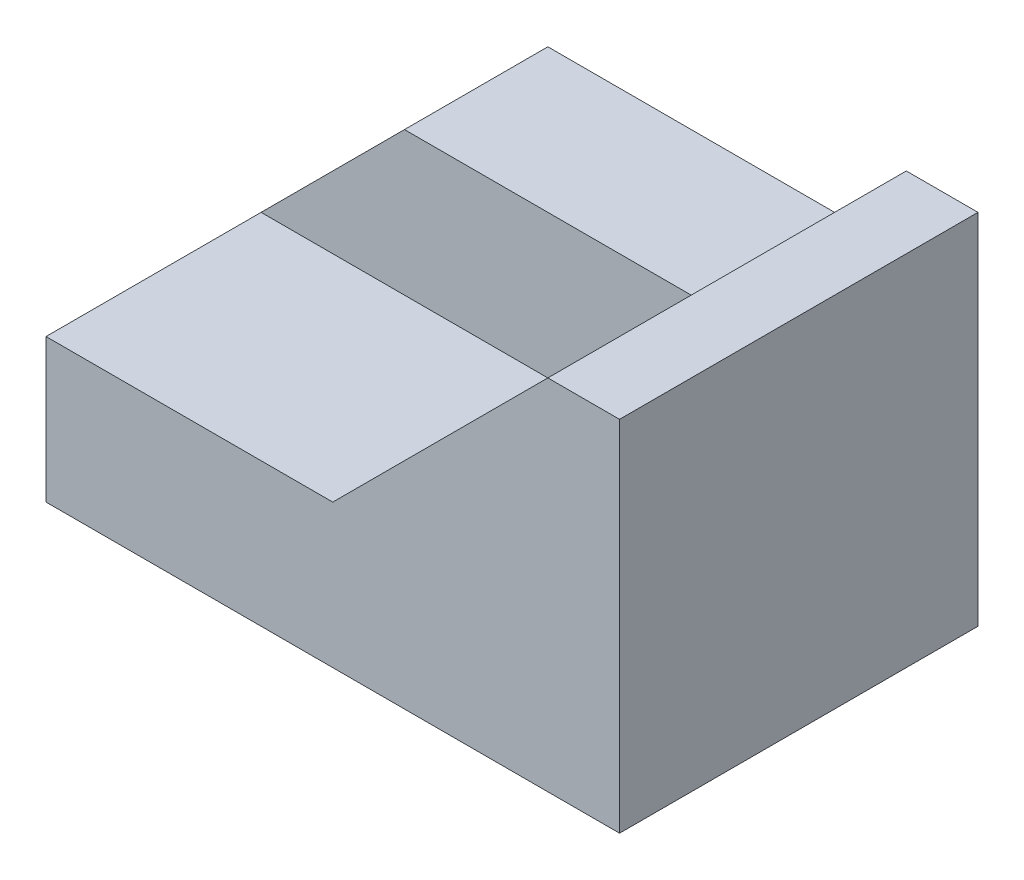
ISO-10303-21;
HEADER;
FILE_DESCRIPTION(('STEP AP214'),'2;1');
FILE_NAME('part.step','',(''),(''),'','','');
FILE_SCHEMA(('AUTOMOTIVE_DESIGN { 1 0 10303 214 1 1 1 1 }'));
ENDSEC;
DATA;
#1=APPLICATION_CONTEXT('core data for automotive mechanical design processes');
#2=APPLICATION_PROTOCOL_DEFINITION('international standard','automotive_design',2000,#1);
#3=PRODUCT_CONTEXT('',#1,'mechanical');
#4=PRODUCT('Part','Part','',(#3));
#5=PRODUCT_RELATED_PRODUCT_CATEGORY('part','',(#4));
#6=PRODUCT_DEFINITION_FORMATION('','',#4);
#7=PRODUCT_DEFINITION_CONTEXT('part definition',#1,'design');
#8=PRODUCT_DEFINITION('design','',#6,#7);
#9=PRODUCT_DEFINITION_SHAPE('','',#8);
#10=(LENGTH_UNIT() NAMED_UNIT(*) SI_UNIT(.MILLI.,.METRE.));
#11=(NAMED_UNIT(*) PLANE_ANGLE_UNIT() SI_UNIT($,.RADIAN.));
#12=(NAMED_UNIT(*) SI_UNIT($,.STERADIAN.) SOLID_ANGLE_UNIT());
#13=UNCERTAINTY_MEASURE_WITH_UNIT(LENGTH_MEASURE(1.E-05),#10,'distance_accuracy_value','');
#14=(GEOMETRIC_REPRESENTATION_CONTEXT(3) GLOBAL_UNCERTAINTY_ASSIGNED_CONTEXT((#13)) GLOBAL_UNIT_ASSIGNED_CONTEXT((#10,
#11,#12)) REPRESENTATION_CONTEXT('',''));
#15=CARTESIAN_POINT('',(0.,0.,0.));
#16=DIRECTION('',(0.,0.,1.));
#17=DIRECTION('',(1.,0.,0.));
#18=AXIS2_PLACEMENT_3D('',#15,#16,#17);
#19=CARTESIAN_POINT('',(60.,40.,0.));
#20=DIRECTION('',(0.,-1.,0.));
#21=DIRECTION('',(0.,0.,-1.));
#22=AXIS2_PLACEMENT_3D('',#19,#20,#21);
#23=PLANE('',#22);
#24=DIRECTION('',(-1.,0.,0.));
#25=VECTOR('',#24,1.);
#26=CARTESIAN_POINT('',(60.,40.,20.));
#27=LINE('',#26,#25);
#28=CARTESIAN_POINT('',(60.,40.,20.));
#29=VERTEX_POINT('',#28);
#30=CARTESIAN_POINT('',(20.,40.,20.));
#31=VERTEX_POINT('',#30);
#32=EDGE_CURVE('E48',#29,#31,#27,.T.);
#33=ORIENTED_EDGE('',*,*,#32,.F.);
#34=DIRECTION('',(0.,0.,1.));
#35=VECTOR('',#34,1.);
#36=CARTESIAN_POINT('',(60.,40.,0.));
#37=LINE('',#36,#35);
#38=CARTESIAN_POINT('',(60.,40.,0.));
#39=VERTEX_POINT('',#38);
#40=EDGE_CURVE('E133',#39,#29,#37,.T.);
#41=ORIENTED_EDGE('',*,*,#40,.F.);
#42=DIRECTION('',(1.,0.,0.));
#43=VECTOR('',#42,1.);
#44=CARTESIAN_POINT('',(60.,40.,0.));
#45=LINE('',#44,#43);
#46=CARTESIAN_POINT('',(20.,40.,0.));
#47=VERTEX_POINT('',#46);
#48=EDGE_CURVE('E56',#47,#39,#45,.T.);
#49=ORIENTED_EDGE('',*,*,#48,.F.);
#50=DIRECTION('',(0.,0.,1.));
#51=VECTOR('',#50,1.);
#52=CARTESIAN_POINT('',(20.,40.,0.));
#53=LINE('',#52,#51);
#54=EDGE_CURVE('E130',#47,#31,#53,.T.);
#55=ORIENTED_EDGE('',*,*,#54,.T.);
#56=EDGE_LOOP('',(#33,#41,#49,#55));
#57=FACE_BOUND('',#56,.T.);
#58=ADVANCED_FACE('F33',(#57),#23,.F.);
#59=CARTESIAN_POINT('',(20.,40.,0.));
#60=DIRECTION('',(0.707106781186548,-0.707106781186548,0.));
#61=DIRECTION('',(0.707106781186548,0.707106781186548,0.));
#62=AXIS2_PLACEMENT_3D('',#59,#60,#61);
#63=PLANE('',#62);
#64=DIRECTION('',(-0.707106781186548,-0.707106781186548,0.));
#65=VECTOR('',#64,1.);
#66=CARTESIAN_POINT('',(20.,40.,20.));
#67=LINE('',#66,#65);
#68=CARTESIAN_POINT('',(0.,20.,20.));
#69=VERTEX_POINT('',#68);
#70=EDGE_CURVE('E112',#31,#69,#67,.T.);
#71=ORIENTED_EDGE('',*,*,#70,.F.);
#72=ORIENTED_EDGE('',*,*,#54,.F.);
#73=DIRECTION('',(0.707106781186548,0.707106781186548,0.));
#74=VECTOR('',#73,1.);
#75=CARTESIAN_POINT('',(20.,40.,0.));
#76=LINE('',#75,#74);
#77=CARTESIAN_POINT('',(0.,20.,0.));
#78=VERTEX_POINT('',#77);
#79=EDGE_CURVE('E129',#78,#47,#76,.T.);
#80=ORIENTED_EDGE('',*,*,#79,.F.);
#81=DIRECTION('',(0.,0.,1.));
#82=VECTOR('',#81,1.);
#83=CARTESIAN_POINT('',(0.,20.,0.));
#84=LINE('',#83,#82);
#85=EDGE_CURVE('E122',#78,#69,#84,.T.);
#86=ORIENTED_EDGE('',*,*,#85,.T.);
#87=EDGE_LOOP('',(#71,#72,#80,#86));
#88=FACE_BOUND('',#87,.T.);
#89=ADVANCED_FACE('F127',(#88),#63,.F.);
#90=CARTESIAN_POINT('',(0.,0.,50.));
#91=DIRECTION('',(1.,0.,0.));
#92=DIRECTION('',(0.,0.,-1.));
#93=AXIS2_PLACEMENT_3D('',#90,#91,#92);
#94=PLANE('',#93);
#95=DIRECTION('',(0.,-1.,0.));
#96=VECTOR('',#95,1.);
#97=CARTESIAN_POINT('',(0.,0.,50.));
#98=LINE('',#97,#96);
#99=CARTESIAN_POINT('',(0.,20.,50.));
#100=VERTEX_POINT('',#99);
#101=CARTESIAN_POINT('',(0.,0.,50.));
#102=VERTEX_POINT('',#101);
#103=EDGE_CURVE('E125',#100,#102,#98,.T.);
#104=ORIENTED_EDGE('',*,*,#103,.F.);
#105=DIRECTION('',(0.,0.,1.));
#106=VECTOR('',#105,1.);
#107=CARTESIAN_POINT('',(0.,20.,20.));
#108=LINE('',#107,#106);
#109=EDGE_CURVE('E106',#69,#100,#108,.T.);
#110=ORIENTED_EDGE('',*,*,#109,.F.);
#111=ORIENTED_EDGE('',*,*,#85,.F.);
#112=DIRECTION('',(0.,-1.,0.));
#113=VECTOR('',#112,1.);
#114=CARTESIAN_POINT('',(0.,0.,0.));
#115=LINE('',#114,#113);
#116=CARTESIAN_POINT('',(0.,0.,0.));
#117=VERTEX_POINT('',#116);
#118=EDGE_CURVE('E149',#78,#117,#115,.T.);
#119=ORIENTED_EDGE('',*,*,#118,.T.);
#120=DIRECTION('',(0.,0.,-1.));
#121=VECTOR('',#120,1.);
#122=CARTESIAN_POINT('',(0.,0.,50.));
#123=LINE('',#122,#121);
#124=EDGE_CURVE('E11',#102,#117,#123,.T.);
#125=ORIENTED_EDGE('',*,*,#124,.F.);
#126=EDGE_LOOP('',(#104,#110,#111,#119,#125));
#127=FACE_BOUND('',#126,.T.);
#128=ADVANCED_FACE('F35',(#127),#94,.F.);
#129=CARTESIAN_POINT('',(0.,0.,50.));
#130=DIRECTION('',(0.,1.,0.));
#131=DIRECTION('',(0.,0.,1.));
#132=AXIS2_PLACEMENT_3D('',#129,#130,#131);
#133=PLANE('',#132);
#134=DIRECTION('',(1.,0.,0.));
#135=VECTOR('',#134,1.);
#136=CARTESIAN_POINT('',(0.,0.,0.));
#137=LINE('',#136,#135);
#138=CARTESIAN_POINT('',(80.,0.,0.));
#139=VERTEX_POINT('',#138);
#140=EDGE_CURVE('E151',#117,#139,#137,.T.);
#141=ORIENTED_EDGE('',*,*,#140,.T.);
#142=DIRECTION('',(0.,0.,-1.));
#143=VECTOR('',#142,1.);
#144=CARTESIAN_POINT('',(80.,0.,50.));
#145=LINE('',#144,#143);
#146=CARTESIAN_POINT('',(80.,0.,50.));
#147=VERTEX_POINT('',#146);
#148=EDGE_CURVE('E41',#147,#139,#145,.T.);
#149=ORIENTED_EDGE('',*,*,#148,.F.);
#150=DIRECTION('',(1.,0.,0.));
#151=VECTOR('',#150,1.);
#152=CARTESIAN_POINT('',(0.,0.,50.));
#153=LINE('',#152,#151);
#154=EDGE_CURVE('E140',#102,#147,#153,.T.);
#155=ORIENTED_EDGE('',*,*,#154,.F.);
#156=ORIENTED_EDGE('',*,*,#124,.T.);
#157=EDGE_LOOP('',(#141,#149,#155,#156));
#158=FACE_BOUND('',#157,.T.);
#159=ADVANCED_FACE('F180',(#158),#133,.F.);
#160=CARTESIAN_POINT('',(80.,0.,50.));
#161=DIRECTION('',(-1.,0.,0.));
#162=DIRECTION('',(0.,0.,1.));
#163=AXIS2_PLACEMENT_3D('',#160,#161,#162);
#164=PLANE('',#163);
#165=DIRECTION('',(0.,1.,0.));
#166=VECTOR('',#165,1.);
#167=CARTESIAN_POINT('',(80.,0.,0.));
#168=LINE('',#167,#166);
#169=CARTESIAN_POINT('',(80.,50.,0.));
#170=VERTEX_POINT('',#169);
#171=EDGE_CURVE('E154',#139,#170,#168,.T.);
#172=ORIENTED_EDGE('',*,*,#171,.T.);
#173=DIRECTION('',(0.,0.,-1.));
#174=VECTOR('',#173,1.);
#175=CARTESIAN_POINT('',(80.,50.,50.));
#176=LINE('',#175,#174);
#177=CARTESIAN_POINT('',(80.,50.,50.));
#178=VERTEX_POINT('',#177);
#179=EDGE_CURVE('E148',#178,#170,#176,.T.);
#180=ORIENTED_EDGE('',*,*,#179,.F.);
#181=DIRECTION('',(0.,1.,0.));
#182=VECTOR('',#181,1.);
#183=CARTESIAN_POINT('',(80.,0.,50.));
#184=LINE('',#183,#182);
#185=EDGE_CURVE('E143',#147,#178,#184,.T.);
#186=ORIENTED_EDGE('',*,*,#185,.F.);
#187=ORIENTED_EDGE('',*,*,#148,.T.);
#188=EDGE_LOOP('',(#172,#180,#186,#187));
#189=FACE_BOUND('',#188,.T.);
#190=ADVANCED_FACE('F164',(#189),#164,.F.);
#191=CARTESIAN_POINT('',(0.,50.,50.));
#192=DIRECTION('',(0.,-1.,0.));
#193=DIRECTION('',(0.,0.,-1.));
#194=AXIS2_PLACEMENT_3D('',#191,#192,#193);
#195=PLANE('',#194);
#196=DIRECTION('',(-1.,0.,0.));
#197=VECTOR('',#196,1.);
#198=CARTESIAN_POINT('',(0.,50.,0.));
#199=LINE('',#198,#197);
#200=CARTESIAN_POINT('',(70.,50.,0.));
#201=VERTEX_POINT('',#200);
#202=EDGE_CURVE('E141',#170,#201,#199,.T.);
#203=ORIENTED_EDGE('',*,*,#202,.T.);
#204=DIRECTION('',(0.,0.,1.));
#205=VECTOR('',#204,1.);
#206=CARTESIAN_POINT('',(70.,50.,0.));
#207=LINE('',#206,#205);
#208=CARTESIAN_POINT('',(70.,50.,50.));
#209=VERTEX_POINT('',#208);
#210=EDGE_CURVE('E152',#201,#209,#207,.T.);
#211=ORIENTED_EDGE('',*,*,#210,.T.);
#212=DIRECTION('',(-1.,0.,0.));
#213=VECTOR('',#212,1.);
#214=CARTESIAN_POINT('',(0.,50.,50.));
#215=LINE('',#214,#213);
#216=EDGE_CURVE('E145',#178,#209,#215,.T.);
#217=ORIENTED_EDGE('',*,*,#216,.F.);
#218=ORIENTED_EDGE('',*,*,#179,.T.);
#219=EDGE_LOOP('',(#203,#211,#217,#218));
#220=FACE_BOUND('',#219,.T.);
#221=ADVANCED_FACE('F175',(#220),#195,.F.);
#222=CARTESIAN_POINT('',(0.,0.,50.));
#223=DIRECTION('',(0.,0.,-1.));
#224=DIRECTION('',(-1.,0.,0.));
#225=AXIS2_PLACEMENT_3D('',#222,#223,#224);
#226=PLANE('',#225);
#227=DIRECTION('',(0.707106781186547,0.707106781186548,0.));
#228=VECTOR('',#227,1.);
#229=CARTESIAN_POINT('',(70.,50.,50.));
#230=LINE('',#229,#228);
#231=CARTESIAN_POINT('',(40.,20.,50.));
#232=VERTEX_POINT('',#231);
#233=EDGE_CURVE('E179',#232,#209,#230,.T.);
#234=ORIENTED_EDGE('',*,*,#233,.F.);
#235=DIRECTION('',(1.,0.,0.));
#236=VECTOR('',#235,1.);
#237=CARTESIAN_POINT('',(0.,20.,50.));
#238=LINE('',#237,#236);
#239=EDGE_CURVE('E117',#100,#232,#238,.T.);
#240=ORIENTED_EDGE('',*,*,#239,.F.);
#241=ORIENTED_EDGE('',*,*,#103,.T.);
#242=ORIENTED_EDGE('',*,*,#154,.T.);
#243=ORIENTED_EDGE('',*,*,#185,.T.);
#244=ORIENTED_EDGE('',*,*,#216,.T.);
#245=EDGE_LOOP('',(#234,#240,#241,#242,#243,#244));
#246=FACE_BOUND('',#245,.T.);
#247=ADVANCED_FACE('F178',(#246),#226,.F.);
#248=CARTESIAN_POINT('',(0.,0.,0.));
#249=DIRECTION('',(0.,0.,-1.));
#250=DIRECTION('',(-1.,0.,0.));
#251=AXIS2_PLACEMENT_3D('',#248,#249,#250);
#252=PLANE('',#251);
#253=DIRECTION('',(0.707106781186547,0.707106781186548,0.));
#254=VECTOR('',#253,1.);
#255=CARTESIAN_POINT('',(70.,50.,0.));
#256=LINE('',#255,#254);
#257=EDGE_CURVE('E131',#39,#201,#256,.T.);
#258=ORIENTED_EDGE('',*,*,#257,.T.);
#259=ORIENTED_EDGE('',*,*,#202,.F.);
#260=ORIENTED_EDGE('',*,*,#171,.F.);
#261=ORIENTED_EDGE('',*,*,#140,.F.);
#262=ORIENTED_EDGE('',*,*,#118,.F.);
#263=ORIENTED_EDGE('',*,*,#79,.T.);
#264=ORIENTED_EDGE('',*,*,#48,.T.);
#265=EDGE_LOOP('',(#258,#259,#260,#261,#262,#263,#264));
#266=FACE_BOUND('',#265,.T.);
#267=ADVANCED_FACE('F171',(#266),#252,.T.);
#268=CARTESIAN_POINT('',(70.,50.,0.));
#269=DIRECTION('',(0.707106781186548,-0.707106781186547,0.));
#270=DIRECTION('',(0.707106781186547,0.707106781186548,0.));
#271=AXIS2_PLACEMENT_3D('',#268,#269,#270);
#272=PLANE('',#271);
#273=ORIENTED_EDGE('',*,*,#233,.T.);
#274=ORIENTED_EDGE('',*,*,#210,.F.);
#275=ORIENTED_EDGE('',*,*,#257,.F.);
#276=ORIENTED_EDGE('',*,*,#40,.T.);
#277=DIRECTION('',(0.707106781186548,0.707106781186547,0.));
#278=VECTOR('',#277,1.);
#279=CARTESIAN_POINT('',(40.,20.,20.));
#280=LINE('',#279,#278);
#281=CARTESIAN_POINT('',(40.,20.,20.));
#282=VERTEX_POINT('',#281);
#283=EDGE_CURVE('E111',#282,#29,#280,.T.);
#284=ORIENTED_EDGE('',*,*,#283,.F.);
#285=DIRECTION('',(0.,0.,1.));
#286=VECTOR('',#285,1.);
#287=CARTESIAN_POINT('',(40.,20.,20.));
#288=LINE('',#287,#286);
#289=EDGE_CURVE('E109',#282,#232,#288,.T.);
#290=ORIENTED_EDGE('',*,*,#289,.T.);
#291=EDGE_LOOP('',(#273,#274,#275,#276,#284,#290));
#292=FACE_BOUND('',#291,.T.);
#293=ADVANCED_FACE('F188',(#292),#272,.F.);
#294=CARTESIAN_POINT('',(0.,20.,20.));
#295=DIRECTION('',(0.,-1.,0.));
#296=DIRECTION('',(0.,0.,-1.));
#297=AXIS2_PLACEMENT_3D('',#294,#295,#296);
#298=PLANE('',#297);
#299=ORIENTED_EDGE('',*,*,#239,.T.);
#300=ORIENTED_EDGE('',*,*,#289,.F.);
#301=DIRECTION('',(1.,0.,0.));
#302=VECTOR('',#301,1.);
#303=CARTESIAN_POINT('',(0.,20.,20.));
#304=LINE('',#303,#302);
#305=EDGE_CURVE('E102',#69,#282,#304,.T.);
#306=ORIENTED_EDGE('',*,*,#305,.F.);
#307=ORIENTED_EDGE('',*,*,#109,.T.);
#308=EDGE_LOOP('',(#299,#300,#306,#307));
#309=FACE_BOUND('',#308,.T.);
#310=ADVANCED_FACE('F104',(#309),#298,.F.);
#311=CARTESIAN_POINT('',(0.,0.,20.));
#312=DIRECTION('',(0.,0.,1.));
#313=DIRECTION('',(1.,0.,0.));
#314=AXIS2_PLACEMENT_3D('',#311,#312,#313);
#315=PLANE('',#314);
#316=ORIENTED_EDGE('',*,*,#70,.T.);
#317=ORIENTED_EDGE('',*,*,#305,.T.);
#318=ORIENTED_EDGE('',*,*,#283,.T.);
#319=ORIENTED_EDGE('',*,*,#32,.T.);
#320=EDGE_LOOP('',(#316,#317,#318,#319));
#321=FACE_BOUND('',#320,.T.);
#322=ADVANCED_FACE('F114',(#321),#315,.T.);
#323=CLOSED_SHELL('',(#58,#89,#128,#159,#190,#221,#247,#267,#293,#310,#322));
#324=MANIFOLD_SOLID_BREP('B2',#323);
#325=ADVANCED_BREP_SHAPE_REPRESENTATION('',(#18,#324),#14);
#326=SHAPE_DEFINITION_REPRESENTATION(#9,#325);
ENDSEC;
END-ISO-10303-21;
